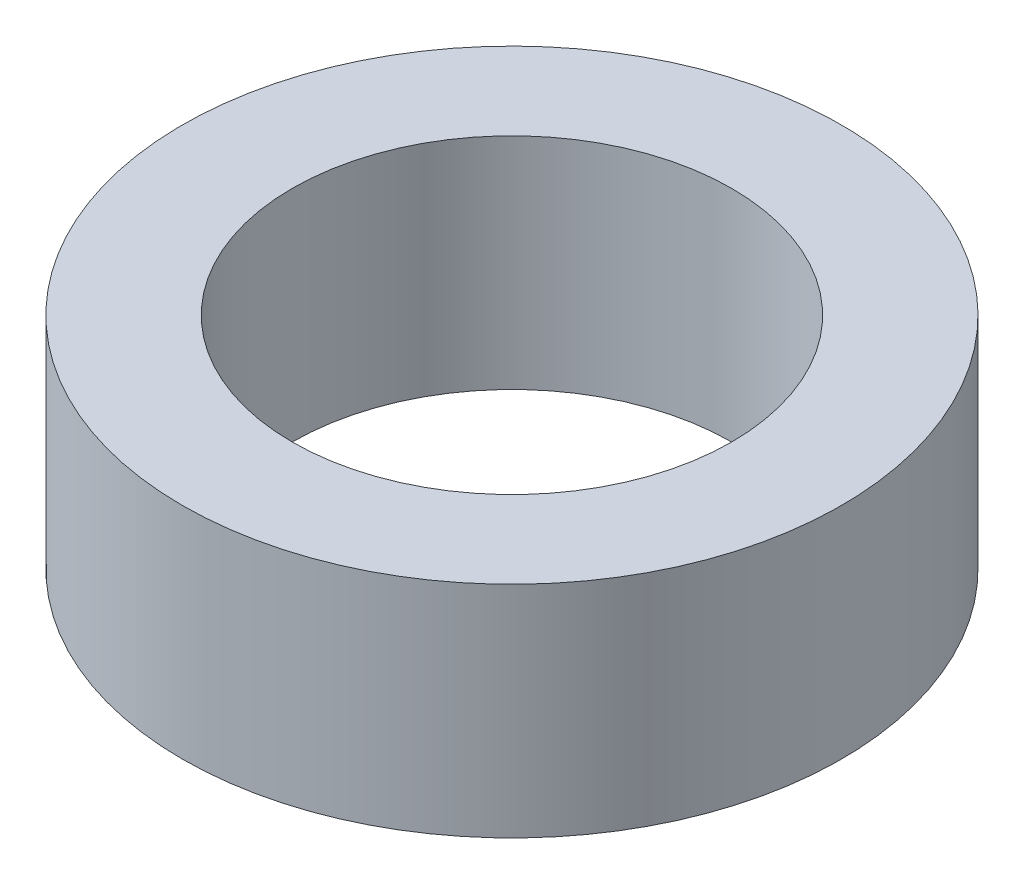
ISO-10303-21;
HEADER;
FILE_DESCRIPTION(('STEP AP214'),'2;1');
FILE_NAME('part.step','',(''),(''),'','','');
FILE_SCHEMA(('AUTOMOTIVE_DESIGN { 1 0 10303 214 1 1 1 1 }'));
ENDSEC;
DATA;
#1=APPLICATION_CONTEXT('core data for automotive mechanical design processes');
#2=APPLICATION_PROTOCOL_DEFINITION('international standard','automotive_design',2000,#1);
#3=PRODUCT_CONTEXT('',#1,'mechanical');
#4=PRODUCT('Part','Part','',(#3));
#5=PRODUCT_RELATED_PRODUCT_CATEGORY('part','',(#4));
#6=PRODUCT_DEFINITION_FORMATION('','',#4);
#7=PRODUCT_DEFINITION_CONTEXT('part definition',#1,'design');
#8=PRODUCT_DEFINITION('design','',#6,#7);
#9=PRODUCT_DEFINITION_SHAPE('','',#8);
#10=(LENGTH_UNIT() NAMED_UNIT(*) SI_UNIT(.MILLI.,.METRE.));
#11=(NAMED_UNIT(*) PLANE_ANGLE_UNIT() SI_UNIT($,.RADIAN.));
#12=(NAMED_UNIT(*) SI_UNIT($,.STERADIAN.) SOLID_ANGLE_UNIT());
#13=UNCERTAINTY_MEASURE_WITH_UNIT(LENGTH_MEASURE(1.E-05),#10,'distance_accuracy_value','');
#14=(GEOMETRIC_REPRESENTATION_CONTEXT(3) GLOBAL_UNCERTAINTY_ASSIGNED_CONTEXT((#13)) GLOBAL_UNIT_ASSIGNED_CONTEXT((#10,
#11,#12)) REPRESENTATION_CONTEXT('',''));
#15=CARTESIAN_POINT('',(0.,0.,0.));
#16=DIRECTION('',(0.,0.,1.));
#17=DIRECTION('',(1.,0.,0.));
#18=AXIS2_PLACEMENT_3D('',#15,#16,#17);
#19=CARTESIAN_POINT('',(0.,2.,0.));
#20=DIRECTION('',(0.,1.,0.));
#21=DIRECTION('',(0.,0.,1.));
#22=AXIS2_PLACEMENT_3D('',#19,#20,#21);
#23=PLANE('',#22);
#24=CARTESIAN_POINT('',(0.,2.,0.));
#25=DIRECTION('',(0.,1.,0.));
#26=DIRECTION('',(0.,0.,1.));
#27=AXIS2_PLACEMENT_3D('',#24,#25,#26);
#28=CIRCLE('',#27,3.);
#29=CARTESIAN_POINT('',(0.,2.,3.));
#30=VERTEX_POINT('',#29);
#31=EDGE_CURVE('E10',#30,#30,#28,.T.);
#32=ORIENTED_EDGE('',*,*,#31,.T.);
#33=EDGE_LOOP('',(#32));
#34=FACE_BOUND('',#33,.T.);
#35=CARTESIAN_POINT('',(0.,2.,0.));
#36=DIRECTION('',(0.,1.,0.));
#37=DIRECTION('',(0.,0.,1.));
#38=AXIS2_PLACEMENT_3D('',#35,#36,#37);
#39=CIRCLE('',#38,2.);
#40=CARTESIAN_POINT('',(0.,2.,2.));
#41=VERTEX_POINT('',#40);
#42=EDGE_CURVE('E50',#41,#41,#39,.T.);
#43=ORIENTED_EDGE('',*,*,#42,.F.);
#44=EDGE_LOOP('',(#43));
#45=FACE_BOUND('',#44,.T.);
#46=ADVANCED_FACE('F37',(#34,#45),#23,.T.);
#47=CARTESIAN_POINT('',(0.,0.,0.));
#48=DIRECTION('',(0.,1.,0.));
#49=DIRECTION('',(0.,0.,1.));
#50=AXIS2_PLACEMENT_3D('',#47,#48,#49);
#51=PLANE('',#50);
#52=CARTESIAN_POINT('',(0.,0.,0.));
#53=DIRECTION('',(0.,1.,0.));
#54=DIRECTION('',(0.,0.,1.));
#55=AXIS2_PLACEMENT_3D('',#52,#53,#54);
#56=CIRCLE('',#55,3.);
#57=CARTESIAN_POINT('',(0.,0.,3.));
#58=VERTEX_POINT('',#57);
#59=EDGE_CURVE('E41',#58,#58,#56,.T.);
#60=ORIENTED_EDGE('',*,*,#59,.F.);
#61=EDGE_LOOP('',(#60));
#62=FACE_BOUND('',#61,.T.);
#63=CARTESIAN_POINT('',(0.,0.,0.));
#64=DIRECTION('',(0.,1.,0.));
#65=DIRECTION('',(0.,0.,1.));
#66=AXIS2_PLACEMENT_3D('',#63,#64,#65);
#67=CIRCLE('',#66,2.);
#68=CARTESIAN_POINT('',(0.,0.,2.));
#69=VERTEX_POINT('',#68);
#70=EDGE_CURVE('E52',#69,#69,#67,.T.);
#71=ORIENTED_EDGE('',*,*,#70,.T.);
#72=EDGE_LOOP('',(#71));
#73=FACE_BOUND('',#72,.T.);
#74=ADVANCED_FACE('F64',(#62,#73),#51,.F.);
#75=CARTESIAN_POINT('',(0.,2.,0.));
#76=DIRECTION('',(0.,-1.,0.));
#77=DIRECTION('',(0.,0.,-1.));
#78=AXIS2_PLACEMENT_3D('',#75,#76,#77);
#79=CYLINDRICAL_SURFACE('',#78,3.);
#80=ORIENTED_EDGE('',*,*,#31,.F.);
#81=EDGE_LOOP('',(#80));
#82=FACE_BOUND('',#81,.T.);
#83=ORIENTED_EDGE('',*,*,#59,.T.);
#84=EDGE_LOOP('',(#83));
#85=FACE_BOUND('',#84,.T.);
#86=ADVANCED_FACE('F39',(#82,#85),#79,.T.);
#87=CARTESIAN_POINT('',(0.,2.,0.));
#88=DIRECTION('',(0.,-1.,0.));
#89=DIRECTION('',(0.,0.,-1.));
#90=AXIS2_PLACEMENT_3D('',#87,#88,#89);
#91=CYLINDRICAL_SURFACE('',#90,2.);
#92=ORIENTED_EDGE('',*,*,#42,.T.);
#93=EDGE_LOOP('',(#92));
#94=FACE_BOUND('',#93,.T.);
#95=ORIENTED_EDGE('',*,*,#70,.F.);
#96=EDGE_LOOP('',(#95));
#97=FACE_BOUND('',#96,.T.);
#98=ADVANCED_FACE('F60',(#94,#97),#91,.F.);
#99=CLOSED_SHELL('',(#46,#74,#86,#98));
#100=MANIFOLD_SOLID_BREP('B2',#99);
#101=ADVANCED_BREP_SHAPE_REPRESENTATION('',(#18,#100),#14);
#102=SHAPE_DEFINITION_REPRESENTATION(#9,#101);
ENDSEC;
END-ISO-10303-21;
